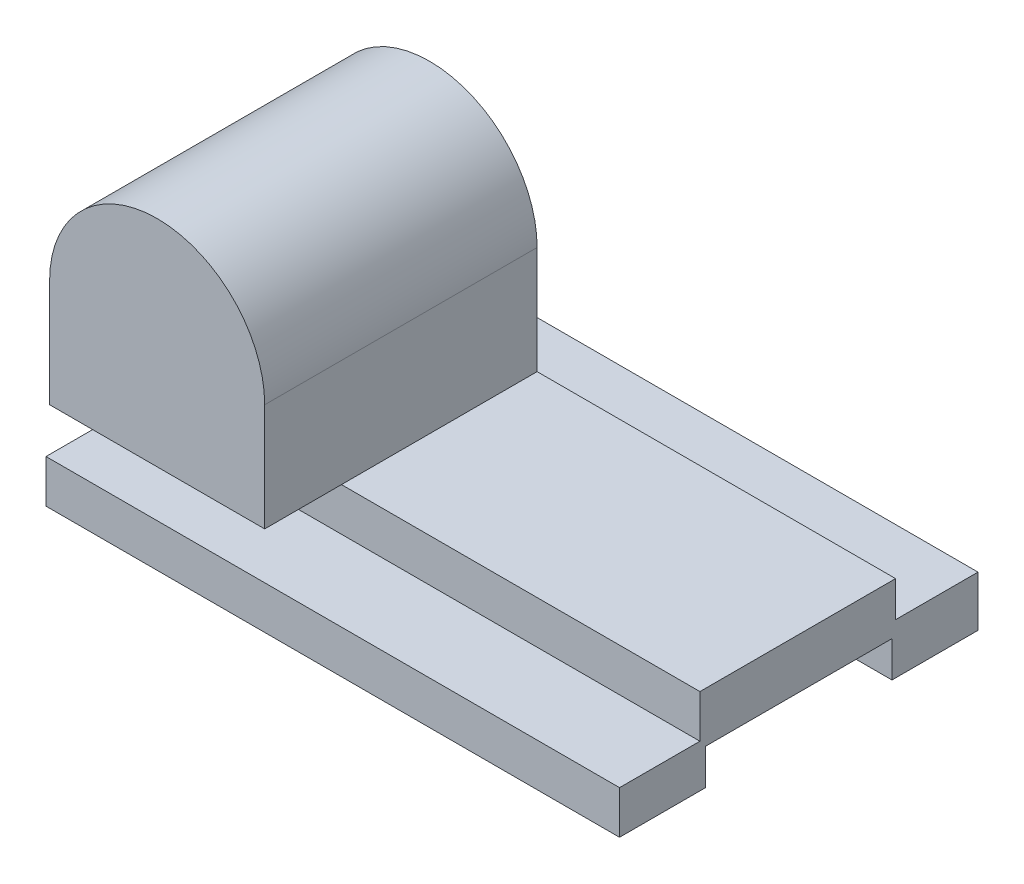
ISO-10303-21;
HEADER;
FILE_DESCRIPTION(('STEP AP214'),'2;1');
FILE_NAME('part.step','',(''),(''),'','','');
FILE_SCHEMA(('AUTOMOTIVE_DESIGN { 1 0 10303 214 1 1 1 1 }'));
ENDSEC;
DATA;
#1=APPLICATION_CONTEXT('core data for automotive mechanical design processes');
#2=APPLICATION_PROTOCOL_DEFINITION('international standard','automotive_design',2000,#1);
#3=PRODUCT_CONTEXT('',#1,'mechanical');
#4=PRODUCT('Part','Part','',(#3));
#5=PRODUCT_RELATED_PRODUCT_CATEGORY('part','',(#4));
#6=PRODUCT_DEFINITION_FORMATION('','',#4);
#7=PRODUCT_DEFINITION_CONTEXT('part definition',#1,'design');
#8=PRODUCT_DEFINITION('design','',#6,#7);
#9=PRODUCT_DEFINITION_SHAPE('','',#8);
#10=(LENGTH_UNIT() NAMED_UNIT(*) SI_UNIT(.MILLI.,.METRE.));
#11=(NAMED_UNIT(*) PLANE_ANGLE_UNIT() SI_UNIT($,.RADIAN.));
#12=(NAMED_UNIT(*) SI_UNIT($,.STERADIAN.) SOLID_ANGLE_UNIT());
#13=UNCERTAINTY_MEASURE_WITH_UNIT(LENGTH_MEASURE(1.E-05),#10,'distance_accuracy_value','');
#14=(GEOMETRIC_REPRESENTATION_CONTEXT(3) GLOBAL_UNCERTAINTY_ASSIGNED_CONTEXT((#13)) GLOBAL_UNIT_ASSIGNED_CONTEXT((#10,
#11,#12)) REPRESENTATION_CONTEXT('',''));
#15=CARTESIAN_POINT('',(0.,0.,0.));
#16=DIRECTION('',(0.,0.,1.));
#17=DIRECTION('',(1.,0.,0.));
#18=AXIS2_PLACEMENT_3D('',#15,#16,#17);
#19=CARTESIAN_POINT('',(-160.,-5.,-50.));
#20=DIRECTION('',(0.,-1.,0.));
#21=DIRECTION('',(0.,0.,-1.));
#22=AXIS2_PLACEMENT_3D('',#19,#20,#21);
#23=PLANE('',#22);
#24=DIRECTION('',(0.,0.,-1.));
#25=VECTOR('',#24,1.);
#26=CARTESIAN_POINT('',(0.,-5.,-50.));
#27=LINE('',#26,#25);
#28=CARTESIAN_POINT('',(0.,-5.,-26.));
#29=VERTEX_POINT('',#28);
#30=CARTESIAN_POINT('',(0.,-5.,-50.));
#31=VERTEX_POINT('',#30);
#32=EDGE_CURVE('E166',#29,#31,#27,.T.);
#33=ORIENTED_EDGE('',*,*,#32,.F.);
#34=DIRECTION('',(1.,0.,0.));
#35=VECTOR('',#34,1.);
#36=CARTESIAN_POINT('',(-160.,-5.,-26.));
#37=LINE('',#36,#35);
#38=CARTESIAN_POINT('',(-160.,-5.,-26.));
#39=VERTEX_POINT('',#38);
#40=EDGE_CURVE('E43',#39,#29,#37,.T.);
#41=ORIENTED_EDGE('',*,*,#40,.F.);
#42=DIRECTION('',(0.,0.,-1.));
#43=VECTOR('',#42,1.);
#44=CARTESIAN_POINT('',(-160.,-5.,-50.));
#45=LINE('',#44,#43);
#46=CARTESIAN_POINT('',(-160.,-5.,-50.));
#47=VERTEX_POINT('',#46);
#48=EDGE_CURVE('E200',#39,#47,#45,.T.);
#49=ORIENTED_EDGE('',*,*,#48,.T.);
#50=DIRECTION('',(1.,0.,0.));
#51=VECTOR('',#50,1.);
#52=CARTESIAN_POINT('',(-160.,-5.,-50.));
#53=LINE('',#52,#51);
#54=EDGE_CURVE('E38',#47,#31,#53,.T.);
#55=ORIENTED_EDGE('',*,*,#54,.T.);
#56=EDGE_LOOP('',(#33,#41,#49,#55));
#57=FACE_BOUND('',#56,.T.);
#58=ADVANCED_FACE('F35',(#57),#23,.T.);
#59=CARTESIAN_POINT('',(-160.,5.,-26.));
#60=DIRECTION('',(0.,0.,1.));
#61=DIRECTION('',(1.,0.,0.));
#62=AXIS2_PLACEMENT_3D('',#59,#60,#61);
#63=PLANE('',#62);
#64=DIRECTION('',(0.,-1.,0.));
#65=VECTOR('',#64,1.);
#66=CARTESIAN_POINT('',(0.,5.,-26.));
#67=LINE('',#66,#65);
#68=CARTESIAN_POINT('',(0.,5.,-26.));
#69=VERTEX_POINT('',#68);
#70=EDGE_CURVE('E197',#69,#29,#67,.T.);
#71=ORIENTED_EDGE('',*,*,#70,.F.);
#72=DIRECTION('',(1.,0.,0.));
#73=VECTOR('',#72,1.);
#74=CARTESIAN_POINT('',(-160.,5.,-26.));
#75=LINE('',#74,#73);
#76=CARTESIAN_POINT('',(-160.,5.,-26.));
#77=VERTEX_POINT('',#76);
#78=EDGE_CURVE('E147',#77,#69,#75,.T.);
#79=ORIENTED_EDGE('',*,*,#78,.F.);
#80=DIRECTION('',(0.,-1.,0.));
#81=VECTOR('',#80,1.);
#82=CARTESIAN_POINT('',(-160.,5.,-26.));
#83=LINE('',#82,#81);
#84=EDGE_CURVE('E156',#77,#39,#83,.T.);
#85=ORIENTED_EDGE('',*,*,#84,.T.);
#86=ORIENTED_EDGE('',*,*,#40,.T.);
#87=EDGE_LOOP('',(#71,#79,#85,#86));
#88=FACE_BOUND('',#87,.T.);
#89=ADVANCED_FACE('F222',(#88),#63,.T.);
#90=CARTESIAN_POINT('',(-160.,5.,26.));
#91=DIRECTION('',(0.,-1.,0.));
#92=DIRECTION('',(0.,0.,-1.));
#93=AXIS2_PLACEMENT_3D('',#90,#91,#92);
#94=PLANE('',#93);
#95=DIRECTION('',(0.,0.,-1.));
#96=VECTOR('',#95,1.);
#97=CARTESIAN_POINT('',(0.,5.,26.));
#98=LINE('',#97,#96);
#99=CARTESIAN_POINT('',(0.,5.,26.));
#100=VERTEX_POINT('',#99);
#101=EDGE_CURVE('E142',#100,#69,#98,.T.);
#102=ORIENTED_EDGE('',*,*,#101,.F.);
#103=DIRECTION('',(1.,0.,0.));
#104=VECTOR('',#103,1.);
#105=CARTESIAN_POINT('',(-160.,5.,26.));
#106=LINE('',#105,#104);
#107=CARTESIAN_POINT('',(-160.,5.,26.));
#108=VERTEX_POINT('',#107);
#109=EDGE_CURVE('E136',#108,#100,#106,.T.);
#110=ORIENTED_EDGE('',*,*,#109,.F.);
#111=DIRECTION('',(0.,0.,-1.));
#112=VECTOR('',#111,1.);
#113=CARTESIAN_POINT('',(-160.,5.,26.));
#114=LINE('',#113,#112);
#115=EDGE_CURVE('E139',#108,#77,#114,.T.);
#116=ORIENTED_EDGE('',*,*,#115,.T.);
#117=ORIENTED_EDGE('',*,*,#78,.T.);
#118=EDGE_LOOP('',(#102,#110,#116,#117));
#119=FACE_BOUND('',#118,.T.);
#120=ADVANCED_FACE('F138',(#119),#94,.T.);
#121=CARTESIAN_POINT('',(-160.,5.,26.));
#122=DIRECTION('',(0.,0.,-1.));
#123=DIRECTION('',(-1.,0.,0.));
#124=AXIS2_PLACEMENT_3D('',#121,#122,#123);
#125=PLANE('',#124);
#126=DIRECTION('',(0.,1.,0.));
#127=VECTOR('',#126,1.);
#128=CARTESIAN_POINT('',(0.,5.,26.));
#129=LINE('',#128,#127);
#130=CARTESIAN_POINT('',(0.,-5.,26.));
#131=VERTEX_POINT('',#130);
#132=EDGE_CURVE('E194',#131,#100,#129,.T.);
#133=ORIENTED_EDGE('',*,*,#132,.F.);
#134=DIRECTION('',(1.,0.,0.));
#135=VECTOR('',#134,1.);
#136=CARTESIAN_POINT('',(-160.,-5.,26.));
#137=LINE('',#136,#135);
#138=CARTESIAN_POINT('',(-160.,-5.,26.));
#139=VERTEX_POINT('',#138);
#140=EDGE_CURVE('E148',#139,#131,#137,.T.);
#141=ORIENTED_EDGE('',*,*,#140,.F.);
#142=DIRECTION('',(0.,1.,0.));
#143=VECTOR('',#142,1.);
#144=CARTESIAN_POINT('',(-160.,5.,26.));
#145=LINE('',#144,#143);
#146=EDGE_CURVE('E154',#139,#108,#145,.T.);
#147=ORIENTED_EDGE('',*,*,#146,.T.);
#148=ORIENTED_EDGE('',*,*,#109,.T.);
#149=EDGE_LOOP('',(#133,#141,#147,#148));
#150=FACE_BOUND('',#149,.T.);
#151=ADVANCED_FACE('F158',(#150),#125,.T.);
#152=CARTESIAN_POINT('',(-160.,-5.,26.));
#153=DIRECTION('',(0.,-1.,0.));
#154=DIRECTION('',(0.,0.,-1.));
#155=AXIS2_PLACEMENT_3D('',#152,#153,#154);
#156=PLANE('',#155);
#157=DIRECTION('',(0.,0.,-1.));
#158=VECTOR('',#157,1.);
#159=CARTESIAN_POINT('',(0.,-5.,26.));
#160=LINE('',#159,#158);
#161=CARTESIAN_POINT('',(0.,-5.00000000000001,50.));
#162=VERTEX_POINT('',#161);
#163=EDGE_CURVE('E191',#162,#131,#160,.T.);
#164=ORIENTED_EDGE('',*,*,#163,.F.);
#165=DIRECTION('',(1.,0.,0.));
#166=VECTOR('',#165,1.);
#167=CARTESIAN_POINT('',(-160.,-5.00000000000001,50.));
#168=LINE('',#167,#166);
#169=CARTESIAN_POINT('',(-160.,-5.00000000000001,50.));
#170=VERTEX_POINT('',#169);
#171=EDGE_CURVE('E204',#170,#162,#168,.T.);
#172=ORIENTED_EDGE('',*,*,#171,.F.);
#173=DIRECTION('',(0.,0.,-1.));
#174=VECTOR('',#173,1.);
#175=CARTESIAN_POINT('',(-160.,-5.,26.));
#176=LINE('',#175,#174);
#177=EDGE_CURVE('E159',#170,#139,#176,.T.);
#178=ORIENTED_EDGE('',*,*,#177,.T.);
#179=ORIENTED_EDGE('',*,*,#140,.T.);
#180=EDGE_LOOP('',(#164,#172,#178,#179));
#181=FACE_BOUND('',#180,.T.);
#182=ADVANCED_FACE('F235',(#181),#156,.T.);
#183=CARTESIAN_POINT('',(-160.,-5.00000000000001,50.));
#184=DIRECTION('',(0.,0.,1.));
#185=DIRECTION('',(1.,0.,0.));
#186=AXIS2_PLACEMENT_3D('',#183,#184,#185);
#187=PLANE('',#186);
#188=DIRECTION('',(0.,-1.,0.));
#189=VECTOR('',#188,1.);
#190=CARTESIAN_POINT('',(0.,-5.00000000000001,50.));
#191=LINE('',#190,#189);
#192=CARTESIAN_POINT('',(0.,6.99999999999999,50.));
#193=VERTEX_POINT('',#192);
#194=EDGE_CURVE('E188',#193,#162,#191,.T.);
#195=ORIENTED_EDGE('',*,*,#194,.F.);
#196=DIRECTION('',(1.,0.,0.));
#197=VECTOR('',#196,1.);
#198=CARTESIAN_POINT('',(-160.,6.99999999999999,50.));
#199=LINE('',#198,#197);
#200=CARTESIAN_POINT('',(-160.,6.99999999999999,50.));
#201=VERTEX_POINT('',#200);
#202=EDGE_CURVE('E206',#201,#193,#199,.T.);
#203=ORIENTED_EDGE('',*,*,#202,.F.);
#204=DIRECTION('',(0.,-1.,0.));
#205=VECTOR('',#204,1.);
#206=CARTESIAN_POINT('',(-160.,-5.00000000000001,50.));
#207=LINE('',#206,#205);
#208=EDGE_CURVE('E161',#201,#170,#207,.T.);
#209=ORIENTED_EDGE('',*,*,#208,.T.);
#210=ORIENTED_EDGE('',*,*,#171,.T.);
#211=EDGE_LOOP('',(#195,#203,#209,#210));
#212=FACE_BOUND('',#211,.T.);
#213=ADVANCED_FACE('F238',(#212),#187,.T.);
#214=CARTESIAN_POINT('',(-160.,6.99999999999999,50.));
#215=DIRECTION('',(0.,1.,0.));
#216=DIRECTION('',(0.,0.,1.));
#217=AXIS2_PLACEMENT_3D('',#214,#215,#216);
#218=PLANE('',#217);
#219=DIRECTION('',(0.,0.,1.));
#220=VECTOR('',#219,1.);
#221=CARTESIAN_POINT('',(0.,6.99999999999999,50.));
#222=LINE('',#221,#220);
#223=CARTESIAN_POINT('',(0.,6.99999999999999,27.5725190839694));
#224=VERTEX_POINT('',#223);
#225=EDGE_CURVE('E185',#224,#193,#222,.T.);
#226=ORIENTED_EDGE('',*,*,#225,.F.);
#227=DIRECTION('',(1.,0.,0.));
#228=VECTOR('',#227,1.);
#229=CARTESIAN_POINT('',(-160.,6.99999999999999,27.5725190839694));
#230=LINE('',#229,#228);
#231=CARTESIAN_POINT('',(-160.,6.99999999999999,27.5725190839694));
#232=VERTEX_POINT('',#231);
#233=EDGE_CURVE('E208',#232,#224,#230,.T.);
#234=ORIENTED_EDGE('',*,*,#233,.F.);
#235=DIRECTION('',(0.,0.,1.));
#236=VECTOR('',#235,1.);
#237=CARTESIAN_POINT('',(-160.,6.99999999999999,50.));
#238=LINE('',#237,#236);
#239=EDGE_CURVE('E335',#232,#201,#238,.T.);
#240=ORIENTED_EDGE('',*,*,#239,.T.);
#241=ORIENTED_EDGE('',*,*,#202,.T.);
#242=EDGE_LOOP('',(#226,#234,#240,#241));
#243=FACE_BOUND('',#242,.T.);
#244=ADVANCED_FACE('F242',(#243),#218,.T.);
#245=CARTESIAN_POINT('',(-160.,6.99999999999999,27.5725190839694));
#246=DIRECTION('',(0.,0.,1.));
#247=DIRECTION('',(1.,0.,0.));
#248=AXIS2_PLACEMENT_3D('',#245,#246,#247);
#249=PLANE('',#248);
#250=DIRECTION('',(0.,-1.,0.));
#251=VECTOR('',#250,1.);
#252=CARTESIAN_POINT('',(0.,6.99999999999999,27.5725190839694));
#253=LINE('',#252,#251);
#254=CARTESIAN_POINT('',(0.,19.,27.5725190839694));
#255=VERTEX_POINT('',#254);
#256=EDGE_CURVE('E182',#255,#224,#253,.T.);
#257=ORIENTED_EDGE('',*,*,#256,.F.);
#258=DIRECTION('',(1.,0.,0.));
#259=VECTOR('',#258,1.);
#260=CARTESIAN_POINT('',(-160.,19.,27.5725190839694));
#261=LINE('',#260,#259);
#262=CARTESIAN_POINT('',(-100.,19.,27.5725190839694));
#263=VERTEX_POINT('',#262);
#264=EDGE_CURVE('E213',#263,#255,#261,.T.);
#265=ORIENTED_EDGE('',*,*,#264,.F.);
#266=CARTESIAN_POINT('',(-160.,19.,27.5725190839694));
#267=VERTEX_POINT('',#266);
#268=EDGE_CURVE('E210',#267,#263,#261,.T.);
#269=ORIENTED_EDGE('',*,*,#268,.F.);
#270=DIRECTION('',(0.,-1.,0.));
#271=VECTOR('',#270,1.);
#272=CARTESIAN_POINT('',(-160.,6.99999999999999,27.5725190839694));
#273=LINE('',#272,#271);
#274=EDGE_CURVE('E332',#267,#232,#273,.T.);
#275=ORIENTED_EDGE('',*,*,#274,.T.);
#276=ORIENTED_EDGE('',*,*,#233,.T.);
#277=EDGE_LOOP('',(#257,#265,#269,#275,#276));
#278=FACE_BOUND('',#277,.T.);
#279=ADVANCED_FACE('F246',(#278),#249,.T.);
#280=CARTESIAN_POINT('',(-160.,19.,27.5725190839694));
#281=DIRECTION('',(0.,1.,0.));
#282=DIRECTION('',(0.,0.,1.));
#283=AXIS2_PLACEMENT_3D('',#280,#281,#282);
#284=PLANE('',#283);
#285=DIRECTION('',(0.,0.,-1.));
#286=VECTOR('',#285,1.);
#287=CARTESIAN_POINT('',(-100.,19.,48.9923664122137));
#288=LINE('',#287,#286);
#289=CARTESIAN_POINT('',(-100.,19.,-27.0076335877863));
#290=VERTEX_POINT('',#289);
#291=EDGE_CURVE('E11',#263,#290,#288,.T.);
#292=ORIENTED_EDGE('',*,*,#291,.F.);
#293=ORIENTED_EDGE('',*,*,#264,.T.);
#294=DIRECTION('',(0.,0.,1.));
#295=VECTOR('',#294,1.);
#296=CARTESIAN_POINT('',(0.,19.,27.5725190839694));
#297=LINE('',#296,#295);
#298=CARTESIAN_POINT('',(0.,19.,-27.0076335877863));
#299=VERTEX_POINT('',#298);
#300=EDGE_CURVE('E179',#299,#255,#297,.T.);
#301=ORIENTED_EDGE('',*,*,#300,.F.);
#302=DIRECTION('',(1.,0.,0.));
#303=VECTOR('',#302,1.);
#304=CARTESIAN_POINT('',(-160.,19.,-27.0076335877863));
#305=LINE('',#304,#303);
#306=EDGE_CURVE('E214',#290,#299,#305,.T.);
#307=ORIENTED_EDGE('',*,*,#306,.F.);
#308=EDGE_LOOP('',(#292,#293,#301,#307));
#309=FACE_BOUND('',#308,.T.);
#310=ADVANCED_FACE('F250',(#309),#284,.T.);
#311=CARTESIAN_POINT('',(-160.,19.,-27.0076335877863));
#312=DIRECTION('',(0.,0.,-1.));
#313=DIRECTION('',(-1.,0.,0.));
#314=AXIS2_PLACEMENT_3D('',#311,#312,#313);
#315=PLANE('',#314);
#316=DIRECTION('',(0.,1.,0.));
#317=VECTOR('',#316,1.);
#318=CARTESIAN_POINT('',(0.,19.,-27.0076335877863));
#319=LINE('',#318,#317);
#320=CARTESIAN_POINT('',(0.,9.07633587786258,-27.0076335877863));
#321=VERTEX_POINT('',#320);
#322=EDGE_CURVE('E176',#321,#299,#319,.T.);
#323=ORIENTED_EDGE('',*,*,#322,.F.);
#324=DIRECTION('',(1.,0.,0.));
#325=VECTOR('',#324,1.);
#326=CARTESIAN_POINT('',(-160.,9.07633587786258,-27.0076335877863));
#327=LINE('',#326,#325);
#328=CARTESIAN_POINT('',(-160.,9.07633587786258,-27.0076335877863));
#329=VERTEX_POINT('',#328);
#330=EDGE_CURVE('E216',#329,#321,#327,.T.);
#331=ORIENTED_EDGE('',*,*,#330,.F.);
#332=DIRECTION('',(0.,1.,0.));
#333=VECTOR('',#332,1.);
#334=CARTESIAN_POINT('',(-160.,19.,-27.0076335877863));
#335=LINE('',#334,#333);
#336=CARTESIAN_POINT('',(-160.,49.,-27.0076335877863));
#337=VERTEX_POINT('',#336);
#338=EDGE_CURVE('E329',#329,#337,#335,.T.);
#339=ORIENTED_EDGE('',*,*,#338,.T.);
#340=CARTESIAN_POINT('',(-130.,49.,-27.0076335877863));
#341=DIRECTION('',(0.,0.,-1.));
#342=DIRECTION('',(-1.,0.,0.));
#343=AXIS2_PLACEMENT_3D('',#340,#341,#342);
#344=CIRCLE('',#343,30.);
#345=CARTESIAN_POINT('',(-100.,49.,-27.0076335877863));
#346=VERTEX_POINT('',#345);
#347=EDGE_CURVE('E307',#337,#346,#344,.T.);
#348=ORIENTED_EDGE('',*,*,#347,.T.);
#349=DIRECTION('',(0.,-1.,0.));
#350=VECTOR('',#349,1.);
#351=CARTESIAN_POINT('',(-100.,0.,-27.0076335877863));
#352=LINE('',#351,#350);
#353=EDGE_CURVE('E302',#346,#290,#352,.T.);
#354=ORIENTED_EDGE('',*,*,#353,.T.);
#355=ORIENTED_EDGE('',*,*,#306,.T.);
#356=EDGE_LOOP('',(#323,#331,#339,#348,#354,#355));
#357=FACE_BOUND('',#356,.T.);
#358=ADVANCED_FACE('F254',(#357),#315,.T.);
#359=CARTESIAN_POINT('',(-160.,9.07633587786258,-27.0076335877863));
#360=DIRECTION('',(0.,1.,0.));
#361=DIRECTION('',(0.,0.,1.));
#362=AXIS2_PLACEMENT_3D('',#359,#360,#361);
#363=PLANE('',#362);
#364=DIRECTION('',(0.,0.,1.));
#365=VECTOR('',#364,1.);
#366=CARTESIAN_POINT('',(0.,9.07633587786258,-27.0076335877863));
#367=LINE('',#366,#365);
#368=CARTESIAN_POINT('',(0.,9.07633587786258,-50.));
#369=VERTEX_POINT('',#368);
#370=EDGE_CURVE('E173',#369,#321,#367,.T.);
#371=ORIENTED_EDGE('',*,*,#370,.F.);
#372=DIRECTION('',(1.,0.,0.));
#373=VECTOR('',#372,1.);
#374=CARTESIAN_POINT('',(-160.,9.07633587786258,-50.));
#375=LINE('',#374,#373);
#376=CARTESIAN_POINT('',(-160.,9.07633587786258,-50.));
#377=VERTEX_POINT('',#376);
#378=EDGE_CURVE('E217',#377,#369,#375,.T.);
#379=ORIENTED_EDGE('',*,*,#378,.F.);
#380=DIRECTION('',(0.,0.,1.));
#381=VECTOR('',#380,1.);
#382=CARTESIAN_POINT('',(-160.,9.07633587786258,-27.0076335877863));
#383=LINE('',#382,#381);
#384=EDGE_CURVE('E326',#377,#329,#383,.T.);
#385=ORIENTED_EDGE('',*,*,#384,.T.);
#386=ORIENTED_EDGE('',*,*,#330,.T.);
#387=EDGE_LOOP('',(#371,#379,#385,#386));
#388=FACE_BOUND('',#387,.T.);
#389=ADVANCED_FACE('F257',(#388),#363,.T.);
#390=CARTESIAN_POINT('',(-160.,9.07633587786258,-50.));
#391=DIRECTION('',(0.,0.,-1.));
#392=DIRECTION('',(-1.,0.,0.));
#393=AXIS2_PLACEMENT_3D('',#390,#391,#392);
#394=PLANE('',#393);
#395=DIRECTION('',(0.,1.,0.));
#396=VECTOR('',#395,1.);
#397=CARTESIAN_POINT('',(0.,9.07633587786258,-50.));
#398=LINE('',#397,#396);
#399=EDGE_CURVE('E169',#31,#369,#398,.T.);
#400=ORIENTED_EDGE('',*,*,#399,.F.);
#401=ORIENTED_EDGE('',*,*,#54,.F.);
#402=DIRECTION('',(0.,1.,0.));
#403=VECTOR('',#402,1.);
#404=CARTESIAN_POINT('',(-160.,9.07633587786258,-50.));
#405=LINE('',#404,#403);
#406=EDGE_CURVE('E324',#47,#377,#405,.T.);
#407=ORIENTED_EDGE('',*,*,#406,.T.);
#408=ORIENTED_EDGE('',*,*,#378,.T.);
#409=EDGE_LOOP('',(#400,#401,#407,#408));
#410=FACE_BOUND('',#409,.T.);
#411=ADVANCED_FACE('F219',(#410),#394,.T.);
#412=CARTESIAN_POINT('',(-160.,0.,0.));
#413=DIRECTION('',(1.,0.,0.));
#414=DIRECTION('',(0.,0.,-1.));
#415=AXIS2_PLACEMENT_3D('',#412,#413,#414);
#416=PLANE('',#415);
#417=ORIENTED_EDGE('',*,*,#48,.F.);
#418=ORIENTED_EDGE('',*,*,#84,.F.);
#419=ORIENTED_EDGE('',*,*,#115,.F.);
#420=ORIENTED_EDGE('',*,*,#146,.F.);
#421=ORIENTED_EDGE('',*,*,#177,.F.);
#422=ORIENTED_EDGE('',*,*,#208,.F.);
#423=ORIENTED_EDGE('',*,*,#239,.F.);
#424=ORIENTED_EDGE('',*,*,#274,.F.);
#425=DIRECTION('',(0.,0.,-1.));
#426=VECTOR('',#425,1.);
#427=CARTESIAN_POINT('',(-160.,19.,48.9923664122137));
#428=LINE('',#427,#426);
#429=CARTESIAN_POINT('',(-160.,19.,48.9923664122137));
#430=VERTEX_POINT('',#429);
#431=EDGE_CURVE('E170',#430,#267,#428,.T.);
#432=ORIENTED_EDGE('',*,*,#431,.F.);
#433=DIRECTION('',(0.,1.,0.));
#434=VECTOR('',#433,1.);
#435=CARTESIAN_POINT('',(-160.,0.,48.9923664122137));
#436=LINE('',#435,#434);
#437=CARTESIAN_POINT('',(-160.,49.,48.9923664122137));
#438=VERTEX_POINT('',#437);
#439=EDGE_CURVE('E290',#430,#438,#436,.T.);
#440=ORIENTED_EDGE('',*,*,#439,.T.);
#441=DIRECTION('',(0.,0.,-1.));
#442=VECTOR('',#441,1.);
#443=CARTESIAN_POINT('',(-160.,49.,48.9923664122137));
#444=LINE('',#443,#442);
#445=EDGE_CURVE('E313',#438,#337,#444,.T.);
#446=ORIENTED_EDGE('',*,*,#445,.T.);
#447=ORIENTED_EDGE('',*,*,#338,.F.);
#448=ORIENTED_EDGE('',*,*,#384,.F.);
#449=ORIENTED_EDGE('',*,*,#406,.F.);
#450=EDGE_LOOP('',(#417,#418,#419,#420,#421,#422,#423,#424,#432,#440,#446,#447,#448,#449));
#451=FACE_BOUND('',#450,.T.);
#452=ADVANCED_FACE('F152',(#451),#416,.F.);
#453=CARTESIAN_POINT('',(0.,0.,0.));
#454=DIRECTION('',(1.,0.,0.));
#455=DIRECTION('',(0.,0.,-1.));
#456=AXIS2_PLACEMENT_3D('',#453,#454,#455);
#457=PLANE('',#456);
#458=ORIENTED_EDGE('',*,*,#32,.T.);
#459=ORIENTED_EDGE('',*,*,#399,.T.);
#460=ORIENTED_EDGE('',*,*,#370,.T.);
#461=ORIENTED_EDGE('',*,*,#322,.T.);
#462=ORIENTED_EDGE('',*,*,#300,.T.);
#463=ORIENTED_EDGE('',*,*,#256,.T.);
#464=ORIENTED_EDGE('',*,*,#225,.T.);
#465=ORIENTED_EDGE('',*,*,#194,.T.);
#466=ORIENTED_EDGE('',*,*,#163,.T.);
#467=ORIENTED_EDGE('',*,*,#132,.T.);
#468=ORIENTED_EDGE('',*,*,#101,.T.);
#469=ORIENTED_EDGE('',*,*,#70,.T.);
#470=EDGE_LOOP('',(#458,#459,#460,#461,#462,#463,#464,#465,#466,#467,#468,#469));
#471=FACE_BOUND('',#470,.T.);
#472=ADVANCED_FACE('F221',(#471),#457,.T.);
#473=CARTESIAN_POINT('',(0.,19.,48.9923664122137));
#474=DIRECTION('',(0.,1.,0.));
#475=DIRECTION('',(0.,0.,1.));
#476=AXIS2_PLACEMENT_3D('',#473,#474,#475);
#477=PLANE('',#476);
#478=ORIENTED_EDGE('',*,*,#431,.T.);
#479=ORIENTED_EDGE('',*,*,#268,.T.);
#480=CARTESIAN_POINT('',(-100.,19.,48.9923664122137));
#481=VERTEX_POINT('',#480);
#482=EDGE_CURVE('E45',#481,#263,#288,.T.);
#483=ORIENTED_EDGE('',*,*,#482,.F.);
#484=DIRECTION('',(1.,0.,0.));
#485=VECTOR('',#484,1.);
#486=CARTESIAN_POINT('',(0.,19.,48.9923664122137));
#487=LINE('',#486,#485);
#488=EDGE_CURVE('E294',#430,#481,#487,.T.);
#489=ORIENTED_EDGE('',*,*,#488,.F.);
#490=EDGE_LOOP('',(#478,#479,#483,#489));
#491=FACE_BOUND('',#490,.T.);
#492=ADVANCED_FACE('F268',(#491),#477,.F.);
#493=CARTESIAN_POINT('',(-100.,0.,48.9923664122137));
#494=DIRECTION('',(1.,0.,0.));
#495=DIRECTION('',(0.,0.,-1.));
#496=AXIS2_PLACEMENT_3D('',#493,#494,#495);
#497=PLANE('',#496);
#498=ORIENTED_EDGE('',*,*,#353,.F.);
#499=DIRECTION('',(0.,0.,-1.));
#500=VECTOR('',#499,1.);
#501=CARTESIAN_POINT('',(-100.,49.,48.9923664122137));
#502=LINE('',#501,#500);
#503=CARTESIAN_POINT('',(-100.,49.,48.9923664122137));
#504=VERTEX_POINT('',#503);
#505=EDGE_CURVE('E319',#504,#346,#502,.T.);
#506=ORIENTED_EDGE('',*,*,#505,.F.);
#507=DIRECTION('',(0.,-1.,0.));
#508=VECTOR('',#507,1.);
#509=CARTESIAN_POINT('',(-100.,0.,48.9923664122137));
#510=LINE('',#509,#508);
#511=EDGE_CURVE('E304',#504,#481,#510,.T.);
#512=ORIENTED_EDGE('',*,*,#511,.T.);
#513=ORIENTED_EDGE('',*,*,#482,.T.);
#514=ORIENTED_EDGE('',*,*,#291,.T.);
#515=EDGE_LOOP('',(#498,#506,#512,#513,#514));
#516=FACE_BOUND('',#515,.T.);
#517=ADVANCED_FACE('F274',(#516),#497,.T.);
#518=CARTESIAN_POINT('',(-130.,49.,48.9923664122137));
#519=DIRECTION('',(0.,0.,-1.));
#520=DIRECTION('',(-1.,0.,0.));
#521=AXIS2_PLACEMENT_3D('',#518,#519,#520);
#522=CYLINDRICAL_SURFACE('',#521,30.);
#523=ORIENTED_EDGE('',*,*,#347,.F.);
#524=ORIENTED_EDGE('',*,*,#445,.F.);
#525=CARTESIAN_POINT('',(-130.,49.,48.9923664122137));
#526=DIRECTION('',(0.,0.,-1.));
#527=DIRECTION('',(-1.,0.,0.));
#528=AXIS2_PLACEMENT_3D('',#525,#526,#527);
#529=CIRCLE('',#528,30.);
#530=EDGE_CURVE('E298',#438,#504,#529,.T.);
#531=ORIENTED_EDGE('',*,*,#530,.T.);
#532=ORIENTED_EDGE('',*,*,#505,.T.);
#533=EDGE_LOOP('',(#523,#524,#531,#532));
#534=FACE_BOUND('',#533,.T.);
#535=ADVANCED_FACE('F270',(#534),#522,.T.);
#536=CARTESIAN_POINT('',(0.,0.,48.9923664122137));
#537=DIRECTION('',(0.,0.,-1.));
#538=DIRECTION('',(-1.,0.,0.));
#539=AXIS2_PLACEMENT_3D('',#536,#537,#538);
#540=PLANE('',#539);
#541=ORIENTED_EDGE('',*,*,#439,.F.);
#542=ORIENTED_EDGE('',*,*,#488,.T.);
#543=ORIENTED_EDGE('',*,*,#511,.F.);
#544=ORIENTED_EDGE('',*,*,#530,.F.);
#545=EDGE_LOOP('',(#541,#542,#543,#544));
#546=FACE_BOUND('',#545,.T.);
#547=ADVANCED_FACE('F273',(#546),#540,.F.);
#548=CLOSED_SHELL('',(#58,#89,#120,#151,#182,#213,#244,#279,#310,#358,#389,#411,#452,#472,#492,
#517,#535,#547));
#549=MANIFOLD_SOLID_BREP('B2',#548);
#550=ADVANCED_BREP_SHAPE_REPRESENTATION('',(#18,#549),#14);
#551=SHAPE_DEFINITION_REPRESENTATION(#9,#550);
ENDSEC;
END-ISO-10303-21;
